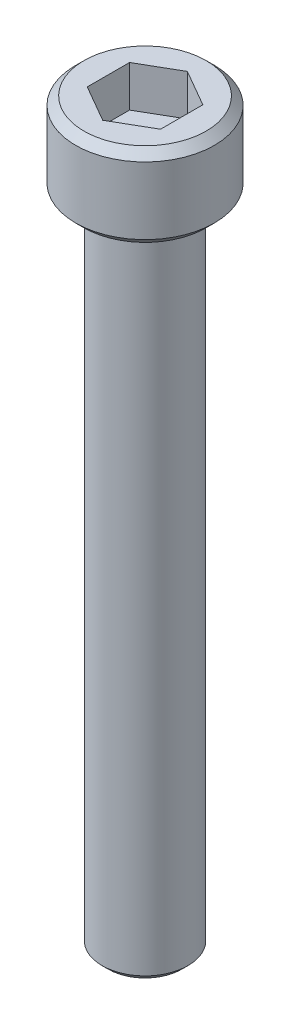
ISO-10303-21;
HEADER;
FILE_DESCRIPTION(('STEP AP214'),'2;1');
FILE_NAME('part.step','',(''),(''),'','','');
FILE_SCHEMA(('AUTOMOTIVE_DESIGN { 1 0 10303 214 1 1 1 1 }'));
ENDSEC;
DATA;
#1=APPLICATION_CONTEXT('core data for automotive mechanical design processes');
#2=APPLICATION_PROTOCOL_DEFINITION('international standard','automotive_design',2000,#1);
#3=PRODUCT_CONTEXT('',#1,'mechanical');
#4=PRODUCT('Part','Part','',(#3));
#5=PRODUCT_RELATED_PRODUCT_CATEGORY('part','',(#4));
#6=PRODUCT_DEFINITION_FORMATION('','',#4);
#7=PRODUCT_DEFINITION_CONTEXT('part definition',#1,'design');
#8=PRODUCT_DEFINITION('design','',#6,#7);
#9=PRODUCT_DEFINITION_SHAPE('','',#8);
#10=(LENGTH_UNIT() NAMED_UNIT(*) SI_UNIT(.MILLI.,.METRE.));
#11=(NAMED_UNIT(*) PLANE_ANGLE_UNIT() SI_UNIT($,.RADIAN.));
#12=(NAMED_UNIT(*) SI_UNIT($,.STERADIAN.) SOLID_ANGLE_UNIT());
#13=UNCERTAINTY_MEASURE_WITH_UNIT(LENGTH_MEASURE(1.E-05),#10,'distance_accuracy_value','');
#14=(GEOMETRIC_REPRESENTATION_CONTEXT(3) GLOBAL_UNCERTAINTY_ASSIGNED_CONTEXT((#13)) GLOBAL_UNIT_ASSIGNED_CONTEXT((#10,
#11,#12)) REPRESENTATION_CONTEXT('',''));
#15=CARTESIAN_POINT('',(0.,0.,0.));
#16=DIRECTION('',(0.,0.,1.));
#17=DIRECTION('',(1.,0.,0.));
#18=AXIS2_PLACEMENT_3D('',#15,#16,#17);
#19=CARTESIAN_POINT('',(1.77799999999999,2.064,3.07958633585744));
#20=DIRECTION('',(0.,1.,0.));
#21=DIRECTION('',(-1.,0.,0.));
#22=AXIS2_PLACEMENT_3D('',#19,#20,#21);
#23=PLANE('',#22);
#24=DIRECTION('',(-0.866025403784438,0.,0.5));
#25=VECTOR('',#24,1.);
#26=CARTESIAN_POINT('',(0.,2.064,-2.05305755723831));
#27=LINE('',#26,#25);
#28=CARTESIAN_POINT('',(0.,2.064,-2.05305755723831));
#29=VERTEX_POINT('',#28);
#30=CARTESIAN_POINT('',(-1.778,2.064,-1.02652877861915));
#31=VERTEX_POINT('',#30);
#32=EDGE_CURVE('E81',#29,#31,#27,.T.);
#33=ORIENTED_EDGE('',*,*,#32,.T.);
#34=DIRECTION('',(0.,0.,1.));
#35=VECTOR('',#34,1.);
#36=CARTESIAN_POINT('',(-1.778,2.064,-1.02652877861915));
#37=LINE('',#36,#35);
#38=CARTESIAN_POINT('',(-1.778,2.064,1.02652877861915));
#39=VERTEX_POINT('',#38);
#40=EDGE_CURVE('E83',#31,#39,#37,.T.);
#41=ORIENTED_EDGE('',*,*,#40,.T.);
#42=DIRECTION('',(0.866025403784439,0.,0.5));
#43=VECTOR('',#42,1.);
#44=CARTESIAN_POINT('',(-1.778,2.064,1.02652877861915));
#45=LINE('',#44,#43);
#46=CARTESIAN_POINT('',(0.,2.064,2.05305755723829));
#47=VERTEX_POINT('',#46);
#48=EDGE_CURVE('E85',#39,#47,#45,.T.);
#49=ORIENTED_EDGE('',*,*,#48,.T.);
#50=DIRECTION('',(0.866025403784438,0.,-0.500000000000001));
#51=VECTOR('',#50,1.);
#52=CARTESIAN_POINT('',(0.,2.064,2.05305755723828));
#53=LINE('',#52,#51);
#54=CARTESIAN_POINT('',(1.77799999999999,2.064,1.02652877861912));
#55=VERTEX_POINT('',#54);
#56=EDGE_CURVE('E159',#47,#55,#53,.T.);
#57=ORIENTED_EDGE('',*,*,#56,.T.);
#58=DIRECTION('',(0.,0.,1.));
#59=VECTOR('',#58,1.);
#60=CARTESIAN_POINT('',(1.77799999999999,2.064,1.02652877861912));
#61=LINE('',#60,#59);
#62=CARTESIAN_POINT('',(1.77799999999999,2.064,-1.02652877861916));
#63=VERTEX_POINT('',#62);
#64=EDGE_CURVE('E166',#55,#63,#61,.F.);
#65=ORIENTED_EDGE('',*,*,#64,.T.);
#66=DIRECTION('',(-0.866025403784439,0.,-0.5));
#67=VECTOR('',#66,1.);
#68=CARTESIAN_POINT('',(1.778,2.064,-1.02652877861916));
#69=LINE('',#68,#67);
#70=EDGE_CURVE('E171',#63,#29,#69,.T.);
#71=ORIENTED_EDGE('',*,*,#70,.T.);
#72=EDGE_LOOP('',(#33,#41,#49,#57,#65,#71));
#73=FACE_BOUND('',#72,.T.);
#74=ADVANCED_FACE('F16',(#73),#23,.T.);
#75=CARTESIAN_POINT('',(-1.778,2.064,1.02652877861915));
#76=DIRECTION('',(-0.5,0.,0.866025403784439));
#77=DIRECTION('',(0.866025403784439,0.,0.5));
#78=AXIS2_PLACEMENT_3D('',#75,#76,#77);
#79=PLANE('',#78);
#80=DIRECTION('',(0.,1.,0.));
#81=VECTOR('',#80,1.);
#82=CARTESIAN_POINT('',(0.,2.064,2.05305755723828));
#83=LINE('',#82,#81);
#84=CARTESIAN_POINT('',(0.,4.064,2.05305755723829));
#85=VERTEX_POINT('',#84);
#86=EDGE_CURVE('E97',#85,#47,#83,.F.);
#87=ORIENTED_EDGE('',*,*,#86,.T.);
#88=ORIENTED_EDGE('',*,*,#48,.F.);
#89=DIRECTION('',(0.,1.,0.));
#90=VECTOR('',#89,1.);
#91=CARTESIAN_POINT('',(-1.778,2.064,1.02652877861915));
#92=LINE('',#91,#90);
#93=CARTESIAN_POINT('',(-1.778,4.064,1.02652877861915));
#94=VERTEX_POINT('',#93);
#95=EDGE_CURVE('E91',#39,#94,#92,.T.);
#96=ORIENTED_EDGE('',*,*,#95,.T.);
#97=DIRECTION('',(-0.866025403784443,0.,-0.499999999999993));
#98=VECTOR('',#97,1.);
#99=CARTESIAN_POINT('',(0.,4.064,2.05305755723828));
#100=LINE('',#99,#98);
#101=EDGE_CURVE('E154',#85,#94,#100,.T.);
#102=ORIENTED_EDGE('',*,*,#101,.F.);
#103=EDGE_LOOP('',(#87,#88,#96,#102));
#104=FACE_BOUND('',#103,.T.);
#105=ADVANCED_FACE('F94',(#104),#79,.F.);
#106=CARTESIAN_POINT('',(-1.778,2.064,-1.02652877861915));
#107=DIRECTION('',(-1.,0.,0.));
#108=DIRECTION('',(0.,0.,1.));
#109=AXIS2_PLACEMENT_3D('',#106,#107,#108);
#110=PLANE('',#109);
#111=ORIENTED_EDGE('',*,*,#95,.F.);
#112=ORIENTED_EDGE('',*,*,#40,.F.);
#113=DIRECTION('',(0.,1.,0.));
#114=VECTOR('',#113,1.);
#115=CARTESIAN_POINT('',(-1.778,2.064,-1.02652877861916));
#116=LINE('',#115,#114);
#117=CARTESIAN_POINT('',(-1.778,4.064,-1.02652877861915));
#118=VERTEX_POINT('',#117);
#119=EDGE_CURVE('E110',#31,#118,#116,.T.);
#120=ORIENTED_EDGE('',*,*,#119,.T.);
#121=DIRECTION('',(0.,0.,1.));
#122=VECTOR('',#121,1.);
#123=CARTESIAN_POINT('',(-1.778,4.064,0.));
#124=LINE('',#123,#122);
#125=EDGE_CURVE('E103',#94,#118,#124,.F.);
#126=ORIENTED_EDGE('',*,*,#125,.F.);
#127=EDGE_LOOP('',(#111,#112,#120,#126));
#128=FACE_BOUND('',#127,.T.);
#129=ADVANCED_FACE('F101',(#128),#110,.F.);
#130=CARTESIAN_POINT('',(0.,2.064,-2.05305755723831));
#131=DIRECTION('',(-0.5,0.,-0.866025403784438));
#132=DIRECTION('',(-0.866025403784438,0.,0.5));
#133=AXIS2_PLACEMENT_3D('',#130,#131,#132);
#134=PLANE('',#133);
#135=ORIENTED_EDGE('',*,*,#119,.F.);
#136=ORIENTED_EDGE('',*,*,#32,.F.);
#137=DIRECTION('',(0.,1.,0.));
#138=VECTOR('',#137,1.);
#139=CARTESIAN_POINT('',(0.,2.064,-2.05305755723831));
#140=LINE('',#139,#138);
#141=CARTESIAN_POINT('',(0.,4.064,-2.05305755723831));
#142=VERTEX_POINT('',#141);
#143=EDGE_CURVE('E169',#29,#142,#140,.T.);
#144=ORIENTED_EDGE('',*,*,#143,.T.);
#145=DIRECTION('',(0.866025403784438,0.,-0.500000000000001));
#146=VECTOR('',#145,1.);
#147=CARTESIAN_POINT('',(-1.778,4.064,-1.02652877861915));
#148=LINE('',#147,#146);
#149=EDGE_CURVE('E149',#118,#142,#148,.T.);
#150=ORIENTED_EDGE('',*,*,#149,.F.);
#151=EDGE_LOOP('',(#135,#136,#144,#150));
#152=FACE_BOUND('',#151,.T.);
#153=ADVANCED_FACE('F176',(#152),#134,.F.);
#154=CARTESIAN_POINT('',(1.778,2.064,-1.02652877861916));
#155=DIRECTION('',(0.5,0.,-0.866025403784439));
#156=DIRECTION('',(-0.866025403784439,0.,-0.5));
#157=AXIS2_PLACEMENT_3D('',#154,#155,#156);
#158=PLANE('',#157);
#159=ORIENTED_EDGE('',*,*,#143,.F.);
#160=ORIENTED_EDGE('',*,*,#70,.F.);
#161=DIRECTION('',(0.,1.,0.));
#162=VECTOR('',#161,1.);
#163=CARTESIAN_POINT('',(1.77799999999999,2.064,-1.02652877861916));
#164=LINE('',#163,#162);
#165=CARTESIAN_POINT('',(1.77799999999999,4.064,-1.02652877861916));
#166=VERTEX_POINT('',#165);
#167=EDGE_CURVE('E164',#63,#166,#164,.T.);
#168=ORIENTED_EDGE('',*,*,#167,.T.);
#169=DIRECTION('',(0.86602540378444,0.,0.499999999999997));
#170=VECTOR('',#169,1.);
#171=CARTESIAN_POINT('',(0.,4.064,-2.05305755723831));
#172=LINE('',#171,#170);
#173=EDGE_CURVE('E145',#142,#166,#172,.T.);
#174=ORIENTED_EDGE('',*,*,#173,.F.);
#175=EDGE_LOOP('',(#159,#160,#168,#174));
#176=FACE_BOUND('',#175,.T.);
#177=ADVANCED_FACE('F188',(#176),#158,.F.);
#178=CARTESIAN_POINT('',(1.77799999999999,2.064,1.02652877861912));
#179=DIRECTION('',(1.,0.,0.));
#180=DIRECTION('',(0.,1.,0.));
#181=AXIS2_PLACEMENT_3D('',#178,#179,#180);
#182=PLANE('',#181);
#183=ORIENTED_EDGE('',*,*,#167,.F.);
#184=ORIENTED_EDGE('',*,*,#64,.F.);
#185=DIRECTION('',(0.,1.,0.));
#186=VECTOR('',#185,1.);
#187=CARTESIAN_POINT('',(1.77799999999999,2.064,1.02652877861912));
#188=LINE('',#187,#186);
#189=CARTESIAN_POINT('',(1.77799999999999,4.064,1.02652877861912));
#190=VERTEX_POINT('',#189);
#191=EDGE_CURVE('E39',#55,#190,#188,.T.);
#192=ORIENTED_EDGE('',*,*,#191,.T.);
#193=DIRECTION('',(0.,0.,1.));
#194=VECTOR('',#193,1.);
#195=CARTESIAN_POINT('',(1.778,4.064,0.));
#196=LINE('',#195,#194);
#197=EDGE_CURVE('E142',#166,#190,#196,.T.);
#198=ORIENTED_EDGE('',*,*,#197,.F.);
#199=EDGE_LOOP('',(#183,#184,#192,#198));
#200=FACE_BOUND('',#199,.T.);
#201=ADVANCED_FACE('F186',(#200),#182,.F.);
#202=CARTESIAN_POINT('',(0.,2.064,2.05305755723828));
#203=DIRECTION('',(0.500000000000001,0.,0.866025403784438));
#204=DIRECTION('',(0.866025403784438,0.,-0.500000000000001));
#205=AXIS2_PLACEMENT_3D('',#202,#203,#204);
#206=PLANE('',#205);
#207=ORIENTED_EDGE('',*,*,#191,.F.);
#208=ORIENTED_EDGE('',*,*,#56,.F.);
#209=ORIENTED_EDGE('',*,*,#86,.F.);
#210=DIRECTION('',(-0.866025403784437,0.,0.500000000000002));
#211=VECTOR('',#210,1.);
#212=CARTESIAN_POINT('',(1.77799999999999,4.064,1.02652877861912));
#213=LINE('',#212,#211);
#214=EDGE_CURVE('E138',#190,#85,#213,.T.);
#215=ORIENTED_EDGE('',*,*,#214,.F.);
#216=EDGE_LOOP('',(#207,#208,#209,#215));
#217=FACE_BOUND('',#216,.T.);
#218=ADVANCED_FACE('F183',(#217),#206,.F.);
#219=CARTESIAN_POINT('',(0.,4.064,0.));
#220=DIRECTION('',(0.,1.,0.));
#221=DIRECTION('',(-1.,0.,0.));
#222=AXIS2_PLACEMENT_3D('',#219,#220,#221);
#223=PLANE('',#222);
#224=ORIENTED_EDGE('',*,*,#197,.T.);
#225=ORIENTED_EDGE('',*,*,#214,.T.);
#226=ORIENTED_EDGE('',*,*,#101,.T.);
#227=ORIENTED_EDGE('',*,*,#125,.T.);
#228=ORIENTED_EDGE('',*,*,#149,.T.);
#229=ORIENTED_EDGE('',*,*,#173,.T.);
#230=EDGE_LOOP('',(#224,#225,#226,#227,#228,#229));
#231=FACE_BOUND('',#230,.T.);
#232=CARTESIAN_POINT('',(0.,4.06400000002805,0.));
#233=DIRECTION('',(0.,-1.,0.));
#234=DIRECTION('',(0.,0.,-1.));
#235=AXIS2_PLACEMENT_3D('',#232,#233,#234);
#236=CIRCLE('',#235,2.96550000001616);
#237=CARTESIAN_POINT('',(0.,4.06400000002805,-2.96550000001616));
#238=VERTEX_POINT('',#237);
#239=EDGE_CURVE('E19',#238,#238,#236,.T.);
#240=ORIENTED_EDGE('',*,*,#239,.F.);
#241=EDGE_LOOP('',(#240));
#242=FACE_BOUND('',#241,.T.);
#243=ADVANCED_FACE('F180',(#231,#242),#223,.T.);
#244=CARTESIAN_POINT('',(0.,3.6640000001853,0.));
#245=DIRECTION('',(0.,-1.,0.));
#246=DIRECTION('',(0.,0.,-1.));
#247=AXIS2_PLACEMENT_3D('',#244,#245,#246);
#248=CONICAL_SURFACE('',#247,3.36549999991576,0.785398163468503);
#249=ORIENTED_EDGE('',*,*,#239,.T.);
#250=EDGE_LOOP('',(#249));
#251=FACE_BOUND('',#250,.T.);
#252=CARTESIAN_POINT('',(0.,3.664,0.));
#253=DIRECTION('',(0.,-1.,0.));
#254=DIRECTION('',(1.,0.,0.));
#255=AXIS2_PLACEMENT_3D('',#252,#253,#254);
#256=CIRCLE('',#255,3.36549999999999);
#257=CARTESIAN_POINT('',(3.36549999999999,3.664,0.));
#258=VERTEX_POINT('',#257);
#259=EDGE_CURVE('E127',#258,#258,#256,.T.);
#260=ORIENTED_EDGE('',*,*,#259,.F.);
#261=EDGE_LOOP('',(#260));
#262=FACE_BOUND('',#261,.T.);
#263=ADVANCED_FACE('F225',(#251,#262),#248,.T.);
#264=CARTESIAN_POINT('',(0.,4.064,0.));
#265=DIRECTION('',(0.,-1.,0.));
#266=DIRECTION('',(1.,0.,0.));
#267=AXIS2_PLACEMENT_3D('',#264,#265,#266);
#268=CYLINDRICAL_SURFACE('',#267,3.36549999999999);
#269=ORIENTED_EDGE('',*,*,#259,.T.);
#270=EDGE_LOOP('',(#269));
#271=FACE_BOUND('',#270,.T.);
#272=CARTESIAN_POINT('',(0.,0.400000000013279,0.));
#273=DIRECTION('',(0.,1.,0.));
#274=DIRECTION('',(0.,0.,1.));
#275=AXIS2_PLACEMENT_3D('',#272,#273,#274);
#276=CIRCLE('',#275,3.36550000002944);
#277=CARTESIAN_POINT('',(0.,0.400000000013279,3.36550000002944));
#278=VERTEX_POINT('',#277);
#279=EDGE_CURVE('E120',#278,#278,#276,.F.);
#280=ORIENTED_EDGE('',*,*,#279,.F.);
#281=EDGE_LOOP('',(#280));
#282=FACE_BOUND('',#281,.T.);
#283=ADVANCED_FACE('F221',(#271,#282),#268,.T.);
#284=CARTESIAN_POINT('',(0.,-31.75,0.));
#285=DIRECTION('',(0.,1.,0.));
#286=DIRECTION('',(-1.,0.,0.));
#287=AXIS2_PLACEMENT_3D('',#284,#285,#286);
#288=PLANE('',#287);
#289=CARTESIAN_POINT('',(0.,-31.7499999999313,0.));
#290=DIRECTION('',(0.,1.,0.));
#291=DIRECTION('',(0.,0.,1.));
#292=AXIS2_PLACEMENT_3D('',#289,#290,#291);
#293=CIRCLE('',#292,1.78279999994402);
#294=CARTESIAN_POINT('',(0.,-31.7499999999313,1.78279999994402));
#295=VERTEX_POINT('',#294);
#296=EDGE_CURVE('E117',#295,#295,#293,.T.);
#297=ORIENTED_EDGE('',*,*,#296,.F.);
#298=EDGE_LOOP('',(#297));
#299=FACE_BOUND('',#298,.T.);
#300=ADVANCED_FACE('F217',(#299),#288,.F.);
#301=CARTESIAN_POINT('',(0.,0.400000000013279,0.));
#302=DIRECTION('',(0.,1.,0.));
#303=DIRECTION('',(0.,0.,1.));
#304=AXIS2_PLACEMENT_3D('',#301,#302,#303);
#305=CONICAL_SURFACE('',#304,3.36550000002944,0.785398163397448);
#306=CARTESIAN_POINT('',(0.,0.,0.));
#307=DIRECTION('',(0.,1.,0.));
#308=DIRECTION('',(0.,0.,1.));
#309=AXIS2_PLACEMENT_3D('',#306,#307,#308);
#310=CIRCLE('',#309,2.96550000001616);
#311=CARTESIAN_POINT('',(0.,0.,2.96550000001616));
#312=VERTEX_POINT('',#311);
#313=EDGE_CURVE('E114',#312,#312,#310,.T.);
#314=ORIENTED_EDGE('',*,*,#313,.T.);
#315=EDGE_LOOP('',(#314));
#316=FACE_BOUND('',#315,.T.);
#317=ORIENTED_EDGE('',*,*,#279,.T.);
#318=EDGE_LOOP('',(#317));
#319=FACE_BOUND('',#318,.T.);
#320=ADVANCED_FACE('F214',(#316,#319),#305,.T.);
#321=CARTESIAN_POINT('',(0.,-31.4500000000066,0.));
#322=DIRECTION('',(0.,1.,0.));
#323=DIRECTION('',(0.,0.,1.));
#324=AXIS2_PLACEMENT_3D('',#321,#322,#323);
#325=CONICAL_SURFACE('',#324,2.08279999992556,0.785398163492187);
#326=ORIENTED_EDGE('',*,*,#296,.T.);
#327=EDGE_LOOP('',(#326));
#328=FACE_BOUND('',#327,.T.);
#329=CARTESIAN_POINT('',(0.,-31.45,0.));
#330=DIRECTION('',(0.,1.,0.));
#331=DIRECTION('',(-1.,0.,0.));
#332=AXIS2_PLACEMENT_3D('',#329,#330,#331);
#333=CIRCLE('',#332,2.0828);
#334=CARTESIAN_POINT('',(-2.0828,-31.45,0.));
#335=VERTEX_POINT('',#334);
#336=EDGE_CURVE('E26',#335,#335,#333,.T.);
#337=ORIENTED_EDGE('',*,*,#336,.F.);
#338=EDGE_LOOP('',(#337));
#339=FACE_BOUND('',#338,.T.);
#340=ADVANCED_FACE('F206',(#328,#339),#325,.T.);
#341=CARTESIAN_POINT('',(0.,0.,0.));
#342=DIRECTION('',(0.,1.,0.));
#343=DIRECTION('',(-1.,0.,0.));
#344=AXIS2_PLACEMENT_3D('',#341,#342,#343);
#345=PLANE('',#344);
#346=CARTESIAN_POINT('',(0.,0.,0.));
#347=DIRECTION('',(0.,1.,0.));
#348=DIRECTION('',(-1.,0.,0.));
#349=AXIS2_PLACEMENT_3D('',#346,#347,#348);
#350=CIRCLE('',#349,2.0828);
#351=CARTESIAN_POINT('',(-2.0828,0.,0.));
#352=VERTEX_POINT('',#351);
#353=EDGE_CURVE('E11',#352,#352,#350,.F.);
#354=ORIENTED_EDGE('',*,*,#353,.F.);
#355=EDGE_LOOP('',(#354));
#356=FACE_BOUND('',#355,.T.);
#357=ORIENTED_EDGE('',*,*,#313,.F.);
#358=EDGE_LOOP('',(#357));
#359=FACE_BOUND('',#358,.T.);
#360=ADVANCED_FACE('F200',(#356,#359),#345,.F.);
#361=CARTESIAN_POINT('',(0.,-31.75,0.));
#362=DIRECTION('',(0.,1.,0.));
#363=DIRECTION('',(-1.,0.,0.));
#364=AXIS2_PLACEMENT_3D('',#361,#362,#363);
#365=CYLINDRICAL_SURFACE('',#364,2.0828);
#366=ORIENTED_EDGE('',*,*,#336,.T.);
#367=EDGE_LOOP('',(#366));
#368=FACE_BOUND('',#367,.T.);
#369=ORIENTED_EDGE('',*,*,#353,.T.);
#370=EDGE_LOOP('',(#369));
#371=FACE_BOUND('',#370,.T.);
#372=ADVANCED_FACE('F198',(#368,#371),#365,.T.);
#373=CLOSED_SHELL('',(#74,#105,#129,#153,#177,#201,#218,#243,#263,#283,#300,#320,#340,#360,#372));
#374=MANIFOLD_SOLID_BREP('B1',#373);
#375=ADVANCED_BREP_SHAPE_REPRESENTATION('',(#18,#374),#14);
#376=SHAPE_DEFINITION_REPRESENTATION(#9,#375);
ENDSEC;
END-ISO-10303-21;
